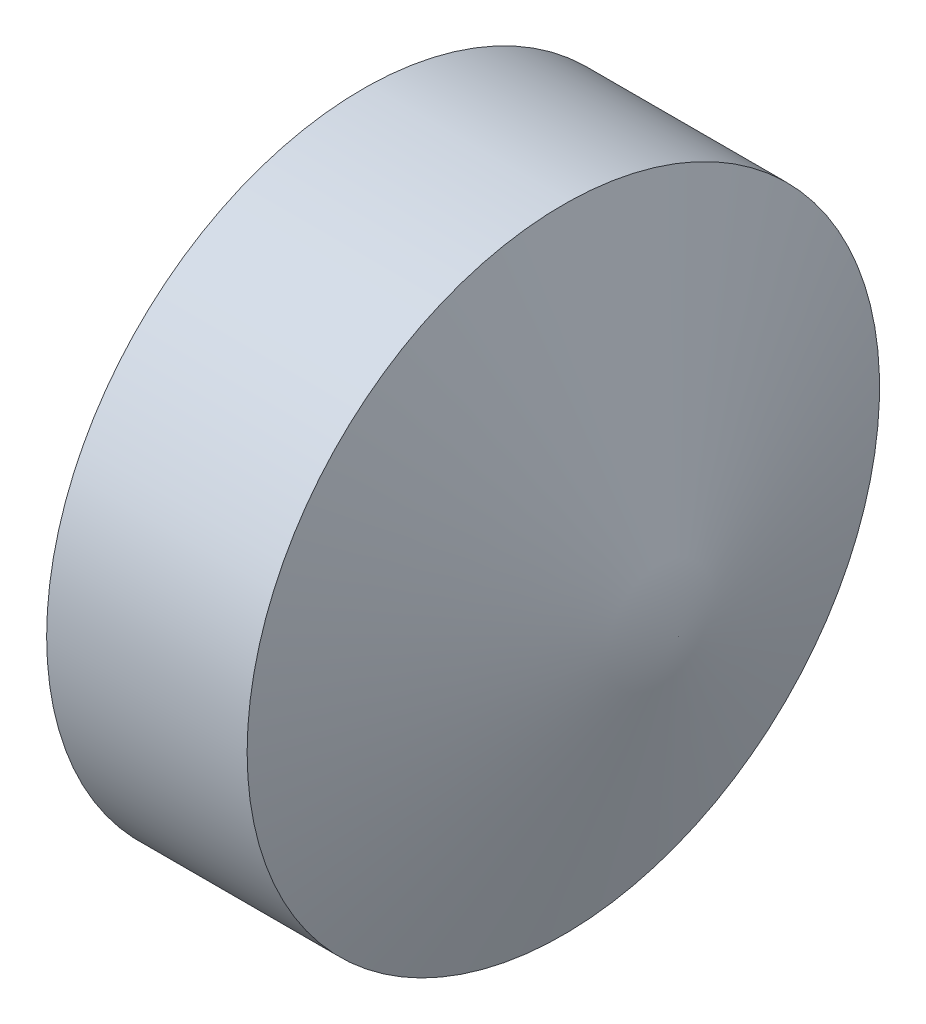
ISO-10303-21;
HEADER;
FILE_DESCRIPTION(('STEP AP214'),'2;1');
FILE_NAME('part.step','',(''),(''),'','','');
FILE_SCHEMA(('AUTOMOTIVE_DESIGN { 1 0 10303 214 1 1 1 1 }'));
ENDSEC;
DATA;
#1=APPLICATION_CONTEXT('core data for automotive mechanical design processes');
#2=APPLICATION_PROTOCOL_DEFINITION('international standard','automotive_design',2000,#1);
#3=PRODUCT_CONTEXT('',#1,'mechanical');
#4=PRODUCT('Part','Part','',(#3));
#5=PRODUCT_RELATED_PRODUCT_CATEGORY('part','',(#4));
#6=PRODUCT_DEFINITION_FORMATION('','',#4);
#7=PRODUCT_DEFINITION_CONTEXT('part definition',#1,'design');
#8=PRODUCT_DEFINITION('design','',#6,#7);
#9=PRODUCT_DEFINITION_SHAPE('','',#8);
#10=(LENGTH_UNIT() NAMED_UNIT(*) SI_UNIT(.MILLI.,.METRE.));
#11=(NAMED_UNIT(*) PLANE_ANGLE_UNIT() SI_UNIT($,.RADIAN.));
#12=(NAMED_UNIT(*) SI_UNIT($,.STERADIAN.) SOLID_ANGLE_UNIT());
#13=UNCERTAINTY_MEASURE_WITH_UNIT(LENGTH_MEASURE(1.E-05),#10,'distance_accuracy_value','');
#14=(GEOMETRIC_REPRESENTATION_CONTEXT(3) GLOBAL_UNCERTAINTY_ASSIGNED_CONTEXT((#13)) GLOBAL_UNIT_ASSIGNED_CONTEXT((#10,
#11,#12)) REPRESENTATION_CONTEXT('',''));
#15=CARTESIAN_POINT('',(0.,0.,0.));
#16=DIRECTION('',(0.,0.,1.));
#17=DIRECTION('',(1.,0.,0.));
#18=AXIS2_PLACEMENT_3D('',#15,#16,#17);
#19=CARTESIAN_POINT('',(3.,0.,0.));
#20=DIRECTION('',(-1.,0.,0.));
#21=DIRECTION('',(0.,0.,1.));
#22=AXIS2_PLACEMENT_3D('',#19,#20,#21);
#23=CYLINDRICAL_SURFACE('',#22,1.35632946891562);
#24=CARTESIAN_POINT('',(1.64635829323957,0.,0.));
#25=DIRECTION('',(-1.,0.,0.));
#26=DIRECTION('',(0.,0.,1.));
#27=AXIS2_PLACEMENT_3D('',#24,#25,#26);
#28=CIRCLE('',#27,1.35632946891562);
#29=CARTESIAN_POINT('',(1.64635829323957,0.,1.35632946891562));
#30=VERTEX_POINT('',#29);
#31=EDGE_CURVE('E11',#30,#30,#28,.F.);
#32=ORIENTED_EDGE('',*,*,#31,.T.);
#33=EDGE_LOOP('',(#32));
#34=FACE_BOUND('',#33,.T.);
#35=CARTESIAN_POINT('',(2.50633644545662,0.,0.));
#36=DIRECTION('',(-1.,0.,0.));
#37=DIRECTION('',(0.,0.,1.));
#38=AXIS2_PLACEMENT_3D('',#35,#36,#37);
#39=CIRCLE('',#38,1.35632946891562);
#40=CARTESIAN_POINT('',(2.50633644545662,0.,1.35632946891562));
#41=VERTEX_POINT('',#40);
#42=EDGE_CURVE('E133',#41,#41,#39,.T.);
#43=ORIENTED_EDGE('',*,*,#42,.T.);
#44=EDGE_LOOP('',(#43));
#45=FACE_BOUND('',#44,.T.);
#46=ADVANCED_FACE('F33',(#34,#45),#23,.T.);
#47=CARTESIAN_POINT('',(1.5,0.,0.));
#48=DIRECTION('',(-1.,0.,0.));
#49=DIRECTION('',(0.,0.,1.));
#50=AXIS2_PLACEMENT_3D('',#47,#48,#49);
#51=PLANE('',#50);
#52=CARTESIAN_POINT('',(1.5,0.,0.));
#53=DIRECTION('',(-1.,0.,0.));
#54=DIRECTION('',(0.,0.,1.));
#55=AXIS2_PLACEMENT_3D('',#52,#53,#54);
#56=CIRCLE('',#55,1.10282946891562);
#57=CARTESIAN_POINT('',(1.5,0.,1.10282946891562));
#58=VERTEX_POINT('',#57);
#59=EDGE_CURVE('E41',#58,#58,#56,.T.);
#60=ORIENTED_EDGE('',*,*,#59,.T.);
#61=EDGE_LOOP('',(#60));
#62=FACE_BOUND('',#61,.T.);
#63=DIRECTION('',(0.,0.,1.));
#64=VECTOR('',#63,1.);
#65=CARTESIAN_POINT('',(1.5,-0.65,-0.375277674973259));
#66=LINE('',#65,#64);
#67=CARTESIAN_POINT('',(1.5,-0.65,-0.375277674973259));
#68=VERTEX_POINT('',#67);
#69=CARTESIAN_POINT('',(1.5,-0.65,0.375277674973254));
#70=VERTEX_POINT('',#69);
#71=EDGE_CURVE('E48',#68,#70,#66,.T.);
#72=ORIENTED_EDGE('',*,*,#71,.F.);
#73=DIRECTION('',(0.,-0.866025403784439,0.499999999999999));
#74=VECTOR('',#73,1.);
#75=CARTESIAN_POINT('',(1.5,0.,-0.750555349946517));
#76=LINE('',#75,#74);
#77=CARTESIAN_POINT('',(1.5,0.,-0.750555349946517));
#78=VERTEX_POINT('',#77);
#79=EDGE_CURVE('E107',#78,#68,#76,.T.);
#80=ORIENTED_EDGE('',*,*,#79,.F.);
#81=DIRECTION('',(0.,-0.866025403784437,-0.500000000000002));
#82=VECTOR('',#81,1.);
#83=CARTESIAN_POINT('',(1.5,0.65,-0.37527767497326));
#84=LINE('',#83,#82);
#85=CARTESIAN_POINT('',(1.5,0.65,-0.37527767497326));
#86=VERTEX_POINT('',#85);
#87=EDGE_CURVE('E110',#86,#78,#84,.T.);
#88=ORIENTED_EDGE('',*,*,#87,.F.);
#89=DIRECTION('',(0.,0.,-1.));
#90=VECTOR('',#89,1.);
#91=CARTESIAN_POINT('',(1.5,0.65,0.375277674973253));
#92=LINE('',#91,#90);
#93=CARTESIAN_POINT('',(1.5,0.65,0.375277674973253));
#94=VERTEX_POINT('',#93);
#95=EDGE_CURVE('E126',#94,#86,#92,.T.);
#96=ORIENTED_EDGE('',*,*,#95,.F.);
#97=DIRECTION('',(0.,0.866025403784437,-0.500000000000002));
#98=VECTOR('',#97,1.);
#99=CARTESIAN_POINT('',(1.5,0.,0.75055534994651));
#100=LINE('',#99,#98);
#101=CARTESIAN_POINT('',(1.5,0.,0.75055534994651));
#102=VERTEX_POINT('',#101);
#103=EDGE_CURVE('E123',#102,#94,#100,.T.);
#104=ORIENTED_EDGE('',*,*,#103,.F.);
#105=DIRECTION('',(0.,0.86602540378444,0.499999999999997));
#106=VECTOR('',#105,1.);
#107=CARTESIAN_POINT('',(1.5,-0.65,0.375277674973254));
#108=LINE('',#107,#106);
#109=EDGE_CURVE('E121',#70,#102,#108,.T.);
#110=ORIENTED_EDGE('',*,*,#109,.F.);
#111=EDGE_LOOP('',(#72,#80,#88,#96,#104,#110));
#112=FACE_BOUND('',#111,.T.);
#113=ADVANCED_FACE('F145',(#62,#112),#51,.T.);
#114=CARTESIAN_POINT('',(2.50633644545662,0.,0.));
#115=DIRECTION('',(-1.,0.,0.));
#116=DIRECTION('',(0.,0.,1.));
#117=AXIS2_PLACEMENT_3D('',#114,#115,#116);
#118=CONICAL_SURFACE('',#117,1.35632946891562,1.22173047639603);
#119=CARTESIAN_POINT('',(3.,0.,0.));
#120=VERTEX_POINT('',#119);
#121=VERTEX_LOOP('',#120);
#122=FACE_BOUND('',#121,.T.);
#123=ORIENTED_EDGE('',*,*,#42,.F.);
#124=EDGE_LOOP('',(#123));
#125=FACE_BOUND('',#124,.T.);
#126=ADVANCED_FACE('F160',(#122,#125),#118,.T.);
#127=CARTESIAN_POINT('',(2.7,-0.65,-0.375277674973259));
#128=DIRECTION('',(0.,-1.,0.));
#129=DIRECTION('',(0.,0.,-1.));
#130=AXIS2_PLACEMENT_3D('',#127,#128,#129);
#131=PLANE('',#130);
#132=ORIENTED_EDGE('',*,*,#71,.T.);
#133=DIRECTION('',(-1.,0.,0.));
#134=VECTOR('',#133,1.);
#135=CARTESIAN_POINT('',(2.7,-0.65,0.375277674973254));
#136=LINE('',#135,#134);
#137=CARTESIAN_POINT('',(2.7,-0.65,0.375277674973254));
#138=VERTEX_POINT('',#137);
#139=EDGE_CURVE('E84',#138,#70,#136,.T.);
#140=ORIENTED_EDGE('',*,*,#139,.F.);
#141=DIRECTION('',(0.,0.,1.));
#142=VECTOR('',#141,1.);
#143=CARTESIAN_POINT('',(2.7,-0.65,-0.375277674973259));
#144=LINE('',#143,#142);
#145=CARTESIAN_POINT('',(2.7,-0.65,-0.375277674973259));
#146=VERTEX_POINT('',#145);
#147=EDGE_CURVE('E88',#146,#138,#144,.T.);
#148=ORIENTED_EDGE('',*,*,#147,.F.);
#149=DIRECTION('',(-1.,0.,0.));
#150=VECTOR('',#149,1.);
#151=CARTESIAN_POINT('',(2.7,-0.65,-0.375277674973259));
#152=LINE('',#151,#150);
#153=EDGE_CURVE('E131',#146,#68,#152,.T.);
#154=ORIENTED_EDGE('',*,*,#153,.T.);
#155=EDGE_LOOP('',(#132,#140,#148,#154));
#156=FACE_BOUND('',#155,.T.);
#157=ADVANCED_FACE('F86',(#156),#131,.F.);
#158=CARTESIAN_POINT('',(2.7,0.,-0.750555349946517));
#159=DIRECTION('',(0.,-0.499999999999999,-0.866025403784439));
#160=DIRECTION('',(0.,0.866025403784439,-0.499999999999999));
#161=AXIS2_PLACEMENT_3D('',#158,#159,#160);
#162=PLANE('',#161);
#163=ORIENTED_EDGE('',*,*,#79,.T.);
#164=ORIENTED_EDGE('',*,*,#153,.F.);
#165=DIRECTION('',(0.,-0.866025403784439,0.499999999999999));
#166=VECTOR('',#165,1.);
#167=CARTESIAN_POINT('',(2.7,0.,-0.750555349946517));
#168=LINE('',#167,#166);
#169=CARTESIAN_POINT('',(2.7,0.,-0.750555349946517));
#170=VERTEX_POINT('',#169);
#171=EDGE_CURVE('E94',#170,#146,#168,.T.);
#172=ORIENTED_EDGE('',*,*,#171,.F.);
#173=DIRECTION('',(-1.,0.,0.));
#174=VECTOR('',#173,1.);
#175=CARTESIAN_POINT('',(2.7,0.,-0.750555349946517));
#176=LINE('',#175,#174);
#177=EDGE_CURVE('E134',#170,#78,#176,.T.);
#178=ORIENTED_EDGE('',*,*,#177,.T.);
#179=EDGE_LOOP('',(#163,#164,#172,#178));
#180=FACE_BOUND('',#179,.T.);
#181=ADVANCED_FACE('F168',(#180),#162,.F.);
#182=CARTESIAN_POINT('',(2.7,0.65,-0.37527767497326));
#183=DIRECTION('',(0.,0.500000000000002,-0.866025403784437));
#184=DIRECTION('',(0.,0.866025403784437,0.500000000000002));
#185=AXIS2_PLACEMENT_3D('',#182,#183,#184);
#186=PLANE('',#185);
#187=ORIENTED_EDGE('',*,*,#87,.T.);
#188=ORIENTED_EDGE('',*,*,#177,.F.);
#189=DIRECTION('',(0.,-0.866025403784437,-0.500000000000002));
#190=VECTOR('',#189,1.);
#191=CARTESIAN_POINT('',(2.7,0.65,-0.37527767497326));
#192=LINE('',#191,#190);
#193=CARTESIAN_POINT('',(2.7,0.65,-0.37527767497326));
#194=VERTEX_POINT('',#193);
#195=EDGE_CURVE('E117',#194,#170,#192,.T.);
#196=ORIENTED_EDGE('',*,*,#195,.F.);
#197=DIRECTION('',(-1.,0.,0.));
#198=VECTOR('',#197,1.);
#199=CARTESIAN_POINT('',(2.7,0.65,-0.37527767497326));
#200=LINE('',#199,#198);
#201=EDGE_CURVE('E136',#194,#86,#200,.T.);
#202=ORIENTED_EDGE('',*,*,#201,.T.);
#203=EDGE_LOOP('',(#187,#188,#196,#202));
#204=FACE_BOUND('',#203,.T.);
#205=ADVANCED_FACE('F178',(#204),#186,.F.);
#206=CARTESIAN_POINT('',(2.7,0.65,0.375277674973253));
#207=DIRECTION('',(0.,1.,0.));
#208=DIRECTION('',(0.,0.,1.));
#209=AXIS2_PLACEMENT_3D('',#206,#207,#208);
#210=PLANE('',#209);
#211=ORIENTED_EDGE('',*,*,#95,.T.);
#212=ORIENTED_EDGE('',*,*,#201,.F.);
#213=DIRECTION('',(0.,0.,-1.));
#214=VECTOR('',#213,1.);
#215=CARTESIAN_POINT('',(2.7,0.65,0.375277674973253));
#216=LINE('',#215,#214);
#217=CARTESIAN_POINT('',(2.7,0.65,0.375277674973253));
#218=VERTEX_POINT('',#217);
#219=EDGE_CURVE('E114',#218,#194,#216,.T.);
#220=ORIENTED_EDGE('',*,*,#219,.F.);
#221=DIRECTION('',(-1.,0.,0.));
#222=VECTOR('',#221,1.);
#223=CARTESIAN_POINT('',(2.7,0.65,0.375277674973253));
#224=LINE('',#223,#222);
#225=EDGE_CURVE('E138',#218,#94,#224,.T.);
#226=ORIENTED_EDGE('',*,*,#225,.T.);
#227=EDGE_LOOP('',(#211,#212,#220,#226));
#228=FACE_BOUND('',#227,.T.);
#229=ADVANCED_FACE('F174',(#228),#210,.F.);
#230=CARTESIAN_POINT('',(2.7,0.,0.75055534994651));
#231=DIRECTION('',(0.,0.500000000000002,0.866025403784437));
#232=DIRECTION('',(0.,-0.866025403784438,0.500000000000002));
#233=AXIS2_PLACEMENT_3D('',#230,#231,#232);
#234=PLANE('',#233);
#235=ORIENTED_EDGE('',*,*,#103,.T.);
#236=ORIENTED_EDGE('',*,*,#225,.F.);
#237=DIRECTION('',(0.,0.866025403784437,-0.500000000000002));
#238=VECTOR('',#237,1.);
#239=CARTESIAN_POINT('',(2.7,0.,0.75055534994651));
#240=LINE('',#239,#238);
#241=CARTESIAN_POINT('',(2.7,0.,0.75055534994651));
#242=VERTEX_POINT('',#241);
#243=EDGE_CURVE('E102',#242,#218,#240,.T.);
#244=ORIENTED_EDGE('',*,*,#243,.F.);
#245=DIRECTION('',(-1.,0.,0.));
#246=VECTOR('',#245,1.);
#247=CARTESIAN_POINT('',(2.7,0.,0.75055534994651));
#248=LINE('',#247,#246);
#249=EDGE_CURVE('E93',#242,#102,#248,.T.);
#250=ORIENTED_EDGE('',*,*,#249,.T.);
#251=EDGE_LOOP('',(#235,#236,#244,#250));
#252=FACE_BOUND('',#251,.T.);
#253=ADVANCED_FACE('F171',(#252),#234,.F.);
#254=CARTESIAN_POINT('',(2.7,-0.65,0.375277674973254));
#255=DIRECTION('',(0.,-0.499999999999997,0.86602540378444));
#256=DIRECTION('',(0.,-0.86602540378444,-0.499999999999997));
#257=AXIS2_PLACEMENT_3D('',#254,#255,#256);
#258=PLANE('',#257);
#259=ORIENTED_EDGE('',*,*,#109,.T.);
#260=ORIENTED_EDGE('',*,*,#249,.F.);
#261=DIRECTION('',(0.,0.86602540378444,0.499999999999997));
#262=VECTOR('',#261,1.);
#263=CARTESIAN_POINT('',(2.7,-0.65,0.375277674973254));
#264=LINE('',#263,#262);
#265=EDGE_CURVE('E97',#138,#242,#264,.T.);
#266=ORIENTED_EDGE('',*,*,#265,.F.);
#267=ORIENTED_EDGE('',*,*,#139,.T.);
#268=EDGE_LOOP('',(#259,#260,#266,#267));
#269=FACE_BOUND('',#268,.T.);
#270=ADVANCED_FACE('F98',(#269),#258,.F.);
#271=CARTESIAN_POINT('',(2.7,0.,0.));
#272=DIRECTION('',(-1.,0.,0.));
#273=DIRECTION('',(0.,0.,1.));
#274=AXIS2_PLACEMENT_3D('',#271,#272,#273);
#275=PLANE('',#274);
#276=ORIENTED_EDGE('',*,*,#147,.T.);
#277=ORIENTED_EDGE('',*,*,#265,.T.);
#278=ORIENTED_EDGE('',*,*,#243,.T.);
#279=ORIENTED_EDGE('',*,*,#219,.T.);
#280=ORIENTED_EDGE('',*,*,#195,.T.);
#281=ORIENTED_EDGE('',*,*,#171,.T.);
#282=EDGE_LOOP('',(#276,#277,#278,#279,#280,#281));
#283=FACE_BOUND('',#282,.T.);
#284=ADVANCED_FACE('F104',(#283),#275,.T.);
#285=CARTESIAN_POINT('',(1.5,0.,0.));
#286=DIRECTION('',(1.,0.,0.));
#287=DIRECTION('',(0.,0.,-1.));
#288=AXIS2_PLACEMENT_3D('',#285,#286,#287);
#289=CONICAL_SURFACE('',#288,1.10282946891562,1.0471975511966);
#290=ORIENTED_EDGE('',*,*,#31,.F.);
#291=EDGE_LOOP('',(#290));
#292=FACE_BOUND('',#291,.T.);
#293=ORIENTED_EDGE('',*,*,#59,.F.);
#294=EDGE_LOOP('',(#293));
#295=FACE_BOUND('',#294,.T.);
#296=ADVANCED_FACE('F35',(#292,#295),#289,.T.);
#297=CLOSED_SHELL('',(#46,#113,#126,#157,#181,#205,#229,#253,#270,#284,#296));
#298=MANIFOLD_SOLID_BREP('B2',#297);
#299=ADVANCED_BREP_SHAPE_REPRESENTATION('',(#18,#298),#14);
#300=SHAPE_DEFINITION_REPRESENTATION(#9,#299);
ENDSEC;
END-ISO-10303-21;
